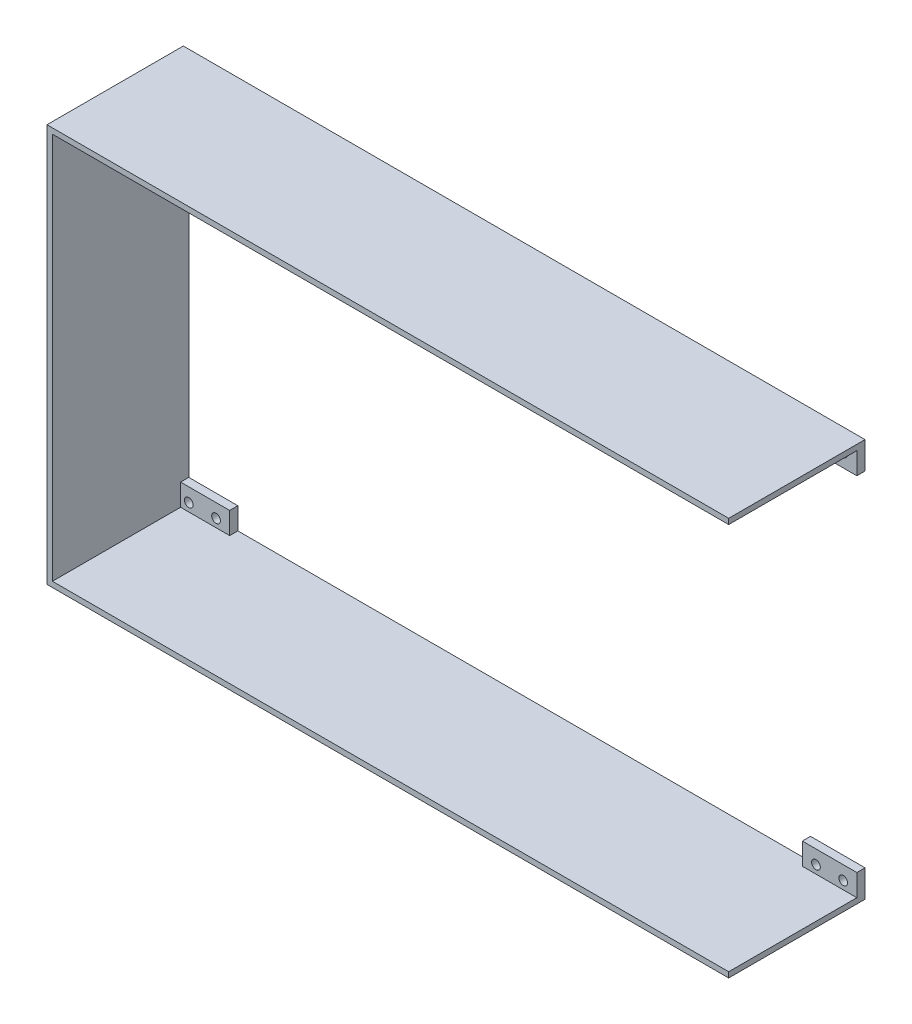
ISO-10303-21;
HEADER;
FILE_DESCRIPTION(('STEP AP214'),'2;1');
FILE_NAME('part.step','',(''),(''),'','','');
FILE_SCHEMA(('AUTOMOTIVE_DESIGN { 1 0 10303 214 1 1 1 1 }'));
ENDSEC;
DATA;
#1=APPLICATION_CONTEXT('core data for automotive mechanical design processes');
#2=APPLICATION_PROTOCOL_DEFINITION('international standard','automotive_design',2000,#1);
#3=PRODUCT_CONTEXT('',#1,'mechanical');
#4=PRODUCT('Part','Part','',(#3));
#5=PRODUCT_RELATED_PRODUCT_CATEGORY('part','',(#4));
#6=PRODUCT_DEFINITION_FORMATION('','',#4);
#7=PRODUCT_DEFINITION_CONTEXT('part definition',#1,'design');
#8=PRODUCT_DEFINITION('design','',#6,#7);
#9=PRODUCT_DEFINITION_SHAPE('','',#8);
#10=(LENGTH_UNIT() NAMED_UNIT(*) SI_UNIT(.MILLI.,.METRE.));
#11=(NAMED_UNIT(*) PLANE_ANGLE_UNIT() SI_UNIT($,.RADIAN.));
#12=(NAMED_UNIT(*) SI_UNIT($,.STERADIAN.) SOLID_ANGLE_UNIT());
#13=UNCERTAINTY_MEASURE_WITH_UNIT(LENGTH_MEASURE(1.E-05),#10,'distance_accuracy_value','');
#14=(GEOMETRIC_REPRESENTATION_CONTEXT(3) GLOBAL_UNCERTAINTY_ASSIGNED_CONTEXT((#13)) GLOBAL_UNIT_ASSIGNED_CONTEXT((#10,
#11,#12)) REPRESENTATION_CONTEXT('',''));
#15=CARTESIAN_POINT('',(0.,0.,0.));
#16=DIRECTION('',(0.,0.,1.));
#17=DIRECTION('',(1.,0.,0.));
#18=AXIS2_PLACEMENT_3D('',#15,#16,#17);
#19=CARTESIAN_POINT('',(96.8202985640199,95.044477559996,50.));
#20=DIRECTION('',(0.,1.,0.));
#21=DIRECTION('',(0.,0.,1.));
#22=AXIS2_PLACEMENT_3D('',#19,#20,#21);
#23=PLANE('',#22);
#24=DIRECTION('',(-1.,0.,0.));
#25=VECTOR('',#24,1.);
#26=CARTESIAN_POINT('',(96.8202985640199,95.044477559996,3.));
#27=LINE('',#26,#25);
#28=CARTESIAN_POINT('',(-131.17970143598,95.044477559996,3.));
#29=VERTEX_POINT('',#28);
#30=CARTESIAN_POINT('',(-149.17970143598,95.044477559996,3.));
#31=VERTEX_POINT('',#30);
#32=EDGE_CURVE('E58',#29,#31,#27,.T.);
#33=ORIENTED_EDGE('',*,*,#32,.F.);
#34=DIRECTION('',(0.,0.,1.));
#35=VECTOR('',#34,1.);
#36=CARTESIAN_POINT('',(-131.17970143598,95.044477559996,50.));
#37=LINE('',#36,#35);
#38=CARTESIAN_POINT('',(-131.17970143598,95.044477559996,0.));
#39=VERTEX_POINT('',#38);
#40=EDGE_CURVE('E226',#39,#29,#37,.T.);
#41=ORIENTED_EDGE('',*,*,#40,.F.);
#42=DIRECTION('',(1.,0.,0.));
#43=VECTOR('',#42,1.);
#44=CARTESIAN_POINT('',(96.8202985640199,95.044477559996,0.));
#45=LINE('',#44,#43);
#46=CARTESIAN_POINT('',(78.8202985640199,95.044477559996,0.));
#47=VERTEX_POINT('',#46);
#48=EDGE_CURVE('E205',#39,#47,#45,.T.);
#49=ORIENTED_EDGE('',*,*,#48,.T.);
#50=DIRECTION('',(0.,0.,-1.));
#51=VECTOR('',#50,1.);
#52=CARTESIAN_POINT('',(78.8202985640199,95.044477559996,50.));
#53=LINE('',#52,#51);
#54=CARTESIAN_POINT('',(78.8202985640199,95.044477559996,3.));
#55=VERTEX_POINT('',#54);
#56=EDGE_CURVE('E277',#55,#47,#53,.T.);
#57=ORIENTED_EDGE('',*,*,#56,.F.);
#58=DIRECTION('',(-1.,0.,0.));
#59=VECTOR('',#58,1.);
#60=CARTESIAN_POINT('',(96.8202985640199,95.044477559996,3.));
#61=LINE('',#60,#59);
#62=CARTESIAN_POINT('',(98.8202985640199,95.044477559996,3.));
#63=VERTEX_POINT('',#62);
#64=EDGE_CURVE('E284',#63,#55,#61,.T.);
#65=ORIENTED_EDGE('',*,*,#64,.F.);
#66=DIRECTION('',(0.,0.,-1.));
#67=VECTOR('',#66,1.);
#68=CARTESIAN_POINT('',(98.8202985640199,95.044477559996,50.));
#69=LINE('',#68,#67);
#70=CARTESIAN_POINT('',(98.8202985640199,95.044477559996,50.));
#71=VERTEX_POINT('',#70);
#72=EDGE_CURVE('E440',#71,#63,#69,.T.);
#73=ORIENTED_EDGE('',*,*,#72,.F.);
#74=DIRECTION('',(1.,0.,0.));
#75=VECTOR('',#74,1.);
#76=CARTESIAN_POINT('',(-149.17970143598,95.044477559996,50.));
#77=LINE('',#76,#75);
#78=CARTESIAN_POINT('',(-149.17970143598,95.044477559996,50.));
#79=VERTEX_POINT('',#78);
#80=EDGE_CURVE('E401',#79,#71,#77,.T.);
#81=ORIENTED_EDGE('',*,*,#80,.F.);
#82=DIRECTION('',(0.,0.,-1.));
#83=VECTOR('',#82,1.);
#84=CARTESIAN_POINT('',(-149.17970143598,95.044477559996,50.));
#85=LINE('',#84,#83);
#86=EDGE_CURVE('E444',#79,#31,#85,.T.);
#87=ORIENTED_EDGE('',*,*,#86,.T.);
#88=EDGE_LOOP('',(#33,#41,#49,#57,#65,#73,#81,#87));
#89=FACE_BOUND('',#88,.T.);
#90=ADVANCED_FACE('F42',(#89),#23,.F.);
#91=CARTESIAN_POINT('',(-149.17970143598,95.044477559996,50.));
#92=DIRECTION('',(-1.,0.,0.));
#93=DIRECTION('',(0.,0.,1.));
#94=AXIS2_PLACEMENT_3D('',#91,#92,#93);
#95=PLANE('',#94);
#96=DIRECTION('',(0.,-1.,0.));
#97=VECTOR('',#96,1.);
#98=CARTESIAN_POINT('',(-149.17970143598,95.044477559996,3.));
#99=LINE('',#98,#97);
#100=CARTESIAN_POINT('',(-149.17970143598,87.044477559996,3.));
#101=VERTEX_POINT('',#100);
#102=EDGE_CURVE('E234',#31,#101,#99,.T.);
#103=ORIENTED_EDGE('',*,*,#102,.F.);
#104=ORIENTED_EDGE('',*,*,#86,.F.);
#105=DIRECTION('',(0.,1.,0.));
#106=VECTOR('',#105,1.);
#107=CARTESIAN_POINT('',(-149.17970143598,95.044477559996,50.));
#108=LINE('',#107,#106);
#109=CARTESIAN_POINT('',(-149.17970143598,-46.955522440004,50.));
#110=VERTEX_POINT('',#109);
#111=EDGE_CURVE('E398',#110,#79,#108,.T.);
#112=ORIENTED_EDGE('',*,*,#111,.F.);
#113=DIRECTION('',(0.,0.,-1.));
#114=VECTOR('',#113,1.);
#115=CARTESIAN_POINT('',(-149.17970143598,-46.955522440004,50.));
#116=LINE('',#115,#114);
#117=CARTESIAN_POINT('',(-149.17970143598,-46.955522440004,3.));
#118=VERTEX_POINT('',#117);
#119=EDGE_CURVE('E447',#110,#118,#116,.T.);
#120=ORIENTED_EDGE('',*,*,#119,.T.);
#121=DIRECTION('',(0.,-1.,0.));
#122=VECTOR('',#121,1.);
#123=CARTESIAN_POINT('',(-149.17970143598,95.044477559996,3.));
#124=LINE('',#123,#122);
#125=CARTESIAN_POINT('',(-149.17970143598,-38.955522440004,3.));
#126=VERTEX_POINT('',#125);
#127=EDGE_CURVE('E11',#126,#118,#124,.T.);
#128=ORIENTED_EDGE('',*,*,#127,.F.);
#129=DIRECTION('',(0.,0.,1.));
#130=VECTOR('',#129,1.);
#131=CARTESIAN_POINT('',(-149.17970143598,-38.955522440004,50.));
#132=LINE('',#131,#130);
#133=CARTESIAN_POINT('',(-149.17970143598,-38.955522440004,0.));
#134=VERTEX_POINT('',#133);
#135=EDGE_CURVE('E371',#134,#126,#132,.T.);
#136=ORIENTED_EDGE('',*,*,#135,.F.);
#137=DIRECTION('',(0.,1.,0.));
#138=VECTOR('',#137,1.);
#139=CARTESIAN_POINT('',(-149.17970143598,95.044477559996,0.));
#140=LINE('',#139,#138);
#141=CARTESIAN_POINT('',(-149.17970143598,87.044477559996,0.));
#142=VERTEX_POINT('',#141);
#143=EDGE_CURVE('E423',#134,#142,#140,.T.);
#144=ORIENTED_EDGE('',*,*,#143,.T.);
#145=DIRECTION('',(0.,0.,-1.));
#146=VECTOR('',#145,1.);
#147=CARTESIAN_POINT('',(-149.17970143598,87.044477559996,50.));
#148=LINE('',#147,#146);
#149=EDGE_CURVE('E66',#101,#142,#148,.T.);
#150=ORIENTED_EDGE('',*,*,#149,.F.);
#151=EDGE_LOOP('',(#103,#104,#112,#120,#128,#136,#144,#150));
#152=FACE_BOUND('',#151,.T.);
#153=ADVANCED_FACE('F514',(#152),#95,.F.);
#154=CARTESIAN_POINT('',(-149.17970143598,-46.955522440004,50.));
#155=DIRECTION('',(0.,-1.,0.));
#156=DIRECTION('',(0.,0.,-1.));
#157=AXIS2_PLACEMENT_3D('',#154,#155,#156);
#158=PLANE('',#157);
#159=DIRECTION('',(1.,0.,0.));
#160=VECTOR('',#159,1.);
#161=CARTESIAN_POINT('',(-149.17970143598,-46.955522440004,3.));
#162=LINE('',#161,#160);
#163=CARTESIAN_POINT('',(78.8202985640199,-46.955522440004,3.));
#164=VERTEX_POINT('',#163);
#165=CARTESIAN_POINT('',(98.8202985640199,-46.955522440004,3.));
#166=VERTEX_POINT('',#165);
#167=EDGE_CURVE('E333',#164,#166,#162,.T.);
#168=ORIENTED_EDGE('',*,*,#167,.F.);
#169=DIRECTION('',(0.,0.,1.));
#170=VECTOR('',#169,1.);
#171=CARTESIAN_POINT('',(78.8202985640199,-46.955522440004,50.));
#172=LINE('',#171,#170);
#173=CARTESIAN_POINT('',(78.8202985640199,-46.955522440004,0.));
#174=VERTEX_POINT('',#173);
#175=EDGE_CURVE('E326',#174,#164,#172,.T.);
#176=ORIENTED_EDGE('',*,*,#175,.F.);
#177=DIRECTION('',(-1.,0.,0.));
#178=VECTOR('',#177,1.);
#179=CARTESIAN_POINT('',(-149.17970143598,-46.955522440004,0.));
#180=LINE('',#179,#178);
#181=CARTESIAN_POINT('',(-131.17970143598,-46.955522440004,0.));
#182=VERTEX_POINT('',#181);
#183=EDGE_CURVE('E420',#174,#182,#180,.T.);
#184=ORIENTED_EDGE('',*,*,#183,.T.);
#185=DIRECTION('',(0.,0.,-1.));
#186=VECTOR('',#185,1.);
#187=CARTESIAN_POINT('',(-131.17970143598,-46.955522440004,50.));
#188=LINE('',#187,#186);
#189=CARTESIAN_POINT('',(-131.17970143598,-46.955522440004,3.));
#190=VERTEX_POINT('',#189);
#191=EDGE_CURVE('E375',#190,#182,#188,.T.);
#192=ORIENTED_EDGE('',*,*,#191,.F.);
#193=DIRECTION('',(1.,0.,0.));
#194=VECTOR('',#193,1.);
#195=CARTESIAN_POINT('',(-149.17970143598,-46.955522440004,3.));
#196=LINE('',#195,#194);
#197=EDGE_CURVE('E379',#118,#190,#196,.T.);
#198=ORIENTED_EDGE('',*,*,#197,.F.);
#199=ORIENTED_EDGE('',*,*,#119,.F.);
#200=DIRECTION('',(-1.,0.,0.));
#201=VECTOR('',#200,1.);
#202=CARTESIAN_POINT('',(96.8202985640199,-46.955522440004,50.));
#203=LINE('',#202,#201);
#204=CARTESIAN_POINT('',(98.8202985640199,-46.955522440004,50.));
#205=VERTEX_POINT('',#204);
#206=EDGE_CURVE('E395',#205,#110,#203,.T.);
#207=ORIENTED_EDGE('',*,*,#206,.F.);
#208=DIRECTION('',(0.,0.,-1.));
#209=VECTOR('',#208,1.);
#210=CARTESIAN_POINT('',(98.8202985640199,-46.955522440004,50.));
#211=LINE('',#210,#209);
#212=EDGE_CURVE('E451',#205,#166,#211,.T.);
#213=ORIENTED_EDGE('',*,*,#212,.T.);
#214=EDGE_LOOP('',(#168,#176,#184,#192,#198,#199,#207,#213));
#215=FACE_BOUND('',#214,.T.);
#216=ADVANCED_FACE('F486',(#215),#158,.F.);
#217=CARTESIAN_POINT('',(-151.17970143598,97.044477559996,50.));
#218=DIRECTION('',(1.,0.,0.));
#219=DIRECTION('',(0.,0.,-1.));
#220=AXIS2_PLACEMENT_3D('',#217,#218,#219);
#221=PLANE('',#220);
#222=DIRECTION('',(0.,0.,-1.));
#223=VECTOR('',#222,1.);
#224=CARTESIAN_POINT('',(-151.17970143598,97.044477559996,50.));
#225=LINE('',#224,#223);
#226=CARTESIAN_POINT('',(-151.17970143598,97.044477559996,50.));
#227=VERTEX_POINT('',#226);
#228=CARTESIAN_POINT('',(-151.17970143598,97.044477559996,0.));
#229=VERTEX_POINT('',#228);
#230=EDGE_CURVE('E410',#227,#229,#225,.T.);
#231=ORIENTED_EDGE('',*,*,#230,.T.);
#232=DIRECTION('',(0.,-1.,0.));
#233=VECTOR('',#232,1.);
#234=CARTESIAN_POINT('',(-151.17970143598,97.044477559996,0.));
#235=LINE('',#234,#233);
#236=CARTESIAN_POINT('',(-151.17970143598,-48.955522440004,0.));
#237=VERTEX_POINT('',#236);
#238=EDGE_CURVE('E383',#229,#237,#235,.T.);
#239=ORIENTED_EDGE('',*,*,#238,.T.);
#240=DIRECTION('',(0.,0.,-1.));
#241=VECTOR('',#240,1.);
#242=CARTESIAN_POINT('',(-151.17970143598,-48.955522440004,50.));
#243=LINE('',#242,#241);
#244=CARTESIAN_POINT('',(-151.17970143598,-48.955522440004,50.));
#245=VERTEX_POINT('',#244);
#246=EDGE_CURVE('E51',#245,#237,#243,.T.);
#247=ORIENTED_EDGE('',*,*,#246,.F.);
#248=DIRECTION('',(0.,-1.,0.));
#249=VECTOR('',#248,1.);
#250=CARTESIAN_POINT('',(-151.17970143598,97.044477559996,50.));
#251=LINE('',#250,#249);
#252=EDGE_CURVE('E384',#227,#245,#251,.T.);
#253=ORIENTED_EDGE('',*,*,#252,.F.);
#254=EDGE_LOOP('',(#231,#239,#247,#253));
#255=FACE_BOUND('',#254,.T.);
#256=ADVANCED_FACE('F44',(#255),#221,.F.);
#257=CARTESIAN_POINT('',(-151.17970143598,-48.955522440004,50.));
#258=DIRECTION('',(0.,1.,0.));
#259=DIRECTION('',(0.,0.,1.));
#260=AXIS2_PLACEMENT_3D('',#257,#258,#259);
#261=PLANE('',#260);
#262=DIRECTION('',(1.,0.,0.));
#263=VECTOR('',#262,1.);
#264=CARTESIAN_POINT('',(-151.17970143598,-48.955522440004,0.));
#265=LINE('',#264,#263);
#266=CARTESIAN_POINT('',(98.8202985640199,-48.955522440004,0.));
#267=VERTEX_POINT('',#266);
#268=EDGE_CURVE('E413',#237,#267,#265,.T.);
#269=ORIENTED_EDGE('',*,*,#268,.T.);
#270=DIRECTION('',(0.,0.,-1.));
#271=VECTOR('',#270,1.);
#272=CARTESIAN_POINT('',(98.8202985640199,-48.955522440004,50.));
#273=LINE('',#272,#271);
#274=CARTESIAN_POINT('',(98.8202985640199,-48.955522440004,50.));
#275=VERTEX_POINT('',#274);
#276=EDGE_CURVE('E454',#275,#267,#273,.T.);
#277=ORIENTED_EDGE('',*,*,#276,.F.);
#278=DIRECTION('',(1.,0.,0.));
#279=VECTOR('',#278,1.);
#280=CARTESIAN_POINT('',(-151.17970143598,-48.955522440004,50.));
#281=LINE('',#280,#279);
#282=EDGE_CURVE('E388',#245,#275,#281,.T.);
#283=ORIENTED_EDGE('',*,*,#282,.F.);
#284=ORIENTED_EDGE('',*,*,#246,.T.);
#285=EDGE_LOOP('',(#269,#277,#283,#284));
#286=FACE_BOUND('',#285,.T.);
#287=ADVANCED_FACE('F461',(#286),#261,.F.);
#288=CARTESIAN_POINT('',(98.8202985640199,-46.955522440004,50.));
#289=DIRECTION('',(-1.,0.,0.));
#290=DIRECTION('',(0.,0.,1.));
#291=AXIS2_PLACEMENT_3D('',#288,#289,#290);
#292=PLANE('',#291);
#293=DIRECTION('',(0.,1.,0.));
#294=VECTOR('',#293,1.);
#295=CARTESIAN_POINT('',(98.8202985640199,-46.955522440004,0.));
#296=LINE('',#295,#294);
#297=CARTESIAN_POINT('',(98.8202985640199,-38.955522440004,0.));
#298=VERTEX_POINT('',#297);
#299=EDGE_CURVE('E417',#267,#298,#296,.T.);
#300=ORIENTED_EDGE('',*,*,#299,.T.);
#301=DIRECTION('',(0.,0.,-1.));
#302=VECTOR('',#301,1.);
#303=CARTESIAN_POINT('',(98.8202985640199,-38.955522440004,3.));
#304=LINE('',#303,#302);
#305=CARTESIAN_POINT('',(98.8202985640199,-38.955522440004,3.));
#306=VERTEX_POINT('',#305);
#307=EDGE_CURVE('E288',#306,#298,#304,.T.);
#308=ORIENTED_EDGE('',*,*,#307,.F.);
#309=DIRECTION('',(0.,1.,0.));
#310=VECTOR('',#309,1.);
#311=CARTESIAN_POINT('',(98.8202985640199,-48.955522440004,3.));
#312=LINE('',#311,#310);
#313=EDGE_CURVE('E302',#166,#306,#312,.T.);
#314=ORIENTED_EDGE('',*,*,#313,.F.);
#315=ORIENTED_EDGE('',*,*,#212,.F.);
#316=DIRECTION('',(0.,1.,0.));
#317=VECTOR('',#316,1.);
#318=CARTESIAN_POINT('',(98.8202985640199,-46.955522440004,50.));
#319=LINE('',#318,#317);
#320=EDGE_CURVE('E392',#275,#205,#319,.T.);
#321=ORIENTED_EDGE('',*,*,#320,.F.);
#322=ORIENTED_EDGE('',*,*,#276,.T.);
#323=EDGE_LOOP('',(#300,#308,#314,#315,#321,#322));
#324=FACE_BOUND('',#323,.T.);
#325=ADVANCED_FACE('F472',(#324),#292,.F.);
#326=CARTESIAN_POINT('',(98.8202985640199,97.044477559996,50.));
#327=DIRECTION('',(-1.,0.,0.));
#328=DIRECTION('',(0.,0.,1.));
#329=AXIS2_PLACEMENT_3D('',#326,#327,#328);
#330=PLANE('',#329);
#331=DIRECTION('',(0.,1.,0.));
#332=VECTOR('',#331,1.);
#333=CARTESIAN_POINT('',(98.8202985640199,97.044477559996,0.));
#334=LINE('',#333,#332);
#335=CARTESIAN_POINT('',(98.8202985640199,87.044477559996,0.));
#336=VERTEX_POINT('',#335);
#337=CARTESIAN_POINT('',(98.8202985640199,97.044477559996,0.));
#338=VERTEX_POINT('',#337);
#339=EDGE_CURVE('E428',#336,#338,#334,.T.);
#340=ORIENTED_EDGE('',*,*,#339,.T.);
#341=DIRECTION('',(0.,0.,-1.));
#342=VECTOR('',#341,1.);
#343=CARTESIAN_POINT('',(98.8202985640199,97.044477559996,50.));
#344=LINE('',#343,#342);
#345=CARTESIAN_POINT('',(98.8202985640199,97.044477559996,50.));
#346=VERTEX_POINT('',#345);
#347=EDGE_CURVE('E437',#346,#338,#344,.T.);
#348=ORIENTED_EDGE('',*,*,#347,.F.);
#349=DIRECTION('',(0.,1.,0.));
#350=VECTOR('',#349,1.);
#351=CARTESIAN_POINT('',(98.8202985640199,97.044477559996,50.));
#352=LINE('',#351,#350);
#353=EDGE_CURVE('E404',#71,#346,#352,.T.);
#354=ORIENTED_EDGE('',*,*,#353,.F.);
#355=ORIENTED_EDGE('',*,*,#72,.T.);
#356=DIRECTION('',(0.,1.,0.));
#357=VECTOR('',#356,1.);
#358=CARTESIAN_POINT('',(98.8202985640199,97.044477559996,3.));
#359=LINE('',#358,#357);
#360=CARTESIAN_POINT('',(98.8202985640199,87.044477559996,3.));
#361=VERTEX_POINT('',#360);
#362=EDGE_CURVE('E253',#361,#63,#359,.T.);
#363=ORIENTED_EDGE('',*,*,#362,.F.);
#364=DIRECTION('',(0.,0.,-1.));
#365=VECTOR('',#364,1.);
#366=CARTESIAN_POINT('',(98.8202985640199,87.044477559996,3.));
#367=LINE('',#366,#365);
#368=EDGE_CURVE('E243',#361,#336,#367,.T.);
#369=ORIENTED_EDGE('',*,*,#368,.T.);
#370=EDGE_LOOP('',(#340,#348,#354,#355,#363,#369));
#371=FACE_BOUND('',#370,.T.);
#372=ADVANCED_FACE('F504',(#371),#330,.F.);
#373=CARTESIAN_POINT('',(-151.17970143598,97.044477559996,50.));
#374=DIRECTION('',(0.,-1.,0.));
#375=DIRECTION('',(0.,0.,-1.));
#376=AXIS2_PLACEMENT_3D('',#373,#374,#375);
#377=PLANE('',#376);
#378=DIRECTION('',(-1.,0.,0.));
#379=VECTOR('',#378,1.);
#380=CARTESIAN_POINT('',(-151.17970143598,97.044477559996,0.));
#381=LINE('',#380,#379);
#382=EDGE_CURVE('E389',#338,#229,#381,.T.);
#383=ORIENTED_EDGE('',*,*,#382,.T.);
#384=ORIENTED_EDGE('',*,*,#230,.F.);
#385=DIRECTION('',(-1.,0.,0.));
#386=VECTOR('',#385,1.);
#387=CARTESIAN_POINT('',(-151.17970143598,97.044477559996,50.));
#388=LINE('',#387,#386);
#389=EDGE_CURVE('E407',#346,#227,#388,.T.);
#390=ORIENTED_EDGE('',*,*,#389,.F.);
#391=ORIENTED_EDGE('',*,*,#347,.T.);
#392=EDGE_LOOP('',(#383,#384,#390,#391));
#393=FACE_BOUND('',#392,.T.);
#394=ADVANCED_FACE('F494',(#393),#377,.F.);
#395=CARTESIAN_POINT('',(0.,0.,50.));
#396=DIRECTION('',(0.,0.,1.));
#397=DIRECTION('',(1.,0.,0.));
#398=AXIS2_PLACEMENT_3D('',#395,#396,#397);
#399=PLANE('',#398);
#400=ORIENTED_EDGE('',*,*,#252,.T.);
#401=ORIENTED_EDGE('',*,*,#282,.T.);
#402=ORIENTED_EDGE('',*,*,#320,.T.);
#403=ORIENTED_EDGE('',*,*,#206,.T.);
#404=ORIENTED_EDGE('',*,*,#111,.T.);
#405=ORIENTED_EDGE('',*,*,#80,.T.);
#406=ORIENTED_EDGE('',*,*,#353,.T.);
#407=ORIENTED_EDGE('',*,*,#389,.T.);
#408=EDGE_LOOP('',(#400,#401,#402,#403,#404,#405,#406,#407));
#409=FACE_BOUND('',#408,.T.);
#410=ADVANCED_FACE('F489',(#409),#399,.T.);
#411=CARTESIAN_POINT('',(0.,0.,0.));
#412=DIRECTION('',(0.,0.,1.));
#413=DIRECTION('',(1.,0.,0.));
#414=AXIS2_PLACEMENT_3D('',#411,#412,#413);
#415=PLANE('',#414);
#416=ORIENTED_EDGE('',*,*,#48,.F.);
#417=DIRECTION('',(0.,1.,0.));
#418=VECTOR('',#417,1.);
#419=CARTESIAN_POINT('',(-131.17970143598,97.044477559996,0.));
#420=LINE('',#419,#418);
#421=CARTESIAN_POINT('',(-131.17970143598,87.044477559996,0.));
#422=VERTEX_POINT('',#421);
#423=EDGE_CURVE('E192',#422,#39,#420,.T.);
#424=ORIENTED_EDGE('',*,*,#423,.F.);
#425=DIRECTION('',(1.,0.,0.));
#426=VECTOR('',#425,1.);
#427=CARTESIAN_POINT('',(-151.17970143598,87.044477559996,0.));
#428=LINE('',#427,#426);
#429=EDGE_CURVE('E181',#142,#422,#428,.T.);
#430=ORIENTED_EDGE('',*,*,#429,.F.);
#431=ORIENTED_EDGE('',*,*,#143,.F.);
#432=DIRECTION('',(-1.,0.,0.));
#433=VECTOR('',#432,1.);
#434=CARTESIAN_POINT('',(-151.17970143598,-38.955522440004,0.));
#435=LINE('',#434,#433);
#436=CARTESIAN_POINT('',(-131.17970143598,-38.955522440004,0.));
#437=VERTEX_POINT('',#436);
#438=EDGE_CURVE('E358',#437,#134,#435,.T.);
#439=ORIENTED_EDGE('',*,*,#438,.F.);
#440=DIRECTION('',(0.,1.,0.));
#441=VECTOR('',#440,1.);
#442=CARTESIAN_POINT('',(-131.17970143598,-48.955522440004,0.));
#443=LINE('',#442,#441);
#444=EDGE_CURVE('E350',#182,#437,#443,.T.);
#445=ORIENTED_EDGE('',*,*,#444,.F.);
#446=ORIENTED_EDGE('',*,*,#183,.F.);
#447=DIRECTION('',(0.,-1.,0.));
#448=VECTOR('',#447,1.);
#449=CARTESIAN_POINT('',(78.8202985640199,-48.955522440004,0.));
#450=LINE('',#449,#448);
#451=CARTESIAN_POINT('',(78.8202985640199,-38.955522440004,0.));
#452=VERTEX_POINT('',#451);
#453=EDGE_CURVE('E297',#452,#174,#450,.T.);
#454=ORIENTED_EDGE('',*,*,#453,.F.);
#455=DIRECTION('',(-1.,0.,0.));
#456=VECTOR('',#455,1.);
#457=CARTESIAN_POINT('',(98.8202985640199,-38.955522440004,0.));
#458=LINE('',#457,#456);
#459=EDGE_CURVE('E301',#298,#452,#458,.T.);
#460=ORIENTED_EDGE('',*,*,#459,.F.);
#461=ORIENTED_EDGE('',*,*,#299,.F.);
#462=ORIENTED_EDGE('',*,*,#268,.F.);
#463=ORIENTED_EDGE('',*,*,#238,.F.);
#464=ORIENTED_EDGE('',*,*,#382,.F.);
#465=ORIENTED_EDGE('',*,*,#339,.F.);
#466=DIRECTION('',(1.,0.,0.));
#467=VECTOR('',#466,1.);
#468=CARTESIAN_POINT('',(98.8202985640199,87.044477559996,0.));
#469=LINE('',#468,#467);
#470=CARTESIAN_POINT('',(78.8202985640199,87.044477559996,0.));
#471=VERTEX_POINT('',#470);
#472=EDGE_CURVE('E248',#471,#336,#469,.T.);
#473=ORIENTED_EDGE('',*,*,#472,.F.);
#474=DIRECTION('',(0.,-1.,0.));
#475=VECTOR('',#474,1.);
#476=CARTESIAN_POINT('',(78.8202985640199,97.044477559996,0.));
#477=LINE('',#476,#475);
#478=EDGE_CURVE('E252',#47,#471,#477,.T.);
#479=ORIENTED_EDGE('',*,*,#478,.F.);
#480=EDGE_LOOP('',(#416,#424,#430,#431,#439,#445,#446,#454,#460,#461,#462,#463,#464,#465,#473,#479));
#481=FACE_BOUND('',#480,.T.);
#482=CARTESIAN_POINT('',(93.8202985640198,92.044477559996,0.));
#483=DIRECTION('',(0.,0.,1.));
#484=DIRECTION('',(1.,0.,0.));
#485=AXIS2_PLACEMENT_3D('',#482,#483,#484);
#486=CIRCLE('',#485,1.59999999999996);
#487=CARTESIAN_POINT('',(95.4202985640198,92.044477559996,0.));
#488=VERTEX_POINT('',#487);
#489=EDGE_CURVE('E265',#488,#488,#486,.T.);
#490=ORIENTED_EDGE('',*,*,#489,.T.);
#491=EDGE_LOOP('',(#490));
#492=FACE_BOUND('',#491,.T.);
#493=CARTESIAN_POINT('',(83.8202985640198,92.044477559996,0.));
#494=DIRECTION('',(0.,0.,1.));
#495=DIRECTION('',(1.,0.,0.));
#496=AXIS2_PLACEMENT_3D('',#493,#494,#495);
#497=CIRCLE('',#496,1.59999999999996);
#498=CARTESIAN_POINT('',(85.4202985640198,92.044477559996,0.));
#499=VERTEX_POINT('',#498);
#500=EDGE_CURVE('E273',#499,#499,#497,.T.);
#501=ORIENTED_EDGE('',*,*,#500,.T.);
#502=EDGE_LOOP('',(#501));
#503=FACE_BOUND('',#502,.T.);
#504=CARTESIAN_POINT('',(-146.17970143598,-43.955522440004,0.));
#505=DIRECTION('',(0.,0.,1.));
#506=DIRECTION('',(1.,0.,0.));
#507=AXIS2_PLACEMENT_3D('',#504,#505,#506);
#508=CIRCLE('',#507,1.59999999999996);
#509=CARTESIAN_POINT('',(-144.57970143598,-43.955522440004,0.));
#510=VERTEX_POINT('',#509);
#511=EDGE_CURVE('E342',#510,#510,#508,.T.);
#512=ORIENTED_EDGE('',*,*,#511,.T.);
#513=EDGE_LOOP('',(#512));
#514=FACE_BOUND('',#513,.T.);
#515=CARTESIAN_POINT('',(-136.17970143598,-43.955522440004,0.));
#516=DIRECTION('',(0.,0.,1.));
#517=DIRECTION('',(1.,0.,0.));
#518=AXIS2_PLACEMENT_3D('',#515,#516,#517);
#519=CIRCLE('',#518,1.59999999999996);
#520=CARTESIAN_POINT('',(-134.57970143598,-43.955522440004,0.));
#521=VERTEX_POINT('',#520);
#522=EDGE_CURVE('E337',#521,#521,#519,.T.);
#523=ORIENTED_EDGE('',*,*,#522,.T.);
#524=EDGE_LOOP('',(#523));
#525=FACE_BOUND('',#524,.T.);
#526=CARTESIAN_POINT('',(93.8202985640198,-43.955522440004,0.));
#527=DIRECTION('',(0.,0.,1.));
#528=DIRECTION('',(-1.,0.,0.));
#529=AXIS2_PLACEMENT_3D('',#526,#527,#528);
#530=CIRCLE('',#529,1.59999999999996);
#531=CARTESIAN_POINT('',(92.2202985640198,-43.955522440004,0.));
#532=VERTEX_POINT('',#531);
#533=EDGE_CURVE('E322',#532,#532,#530,.T.);
#534=ORIENTED_EDGE('',*,*,#533,.T.);
#535=EDGE_LOOP('',(#534));
#536=FACE_BOUND('',#535,.T.);
#537=CARTESIAN_POINT('',(83.8202985640198,-43.955522440004,0.));
#538=DIRECTION('',(0.,0.,1.));
#539=DIRECTION('',(-1.,0.,0.));
#540=AXIS2_PLACEMENT_3D('',#537,#538,#539);
#541=CIRCLE('',#540,1.59999999999996);
#542=CARTESIAN_POINT('',(82.2202985640198,-43.955522440004,0.));
#543=VERTEX_POINT('',#542);
#544=EDGE_CURVE('E314',#543,#543,#541,.T.);
#545=ORIENTED_EDGE('',*,*,#544,.T.);
#546=EDGE_LOOP('',(#545));
#547=FACE_BOUND('',#546,.T.);
#548=CARTESIAN_POINT('',(-146.17970143598,92.044477559996,0.));
#549=DIRECTION('',(0.,0.,1.));
#550=DIRECTION('',(-1.,0.,0.));
#551=AXIS2_PLACEMENT_3D('',#548,#549,#550);
#552=CIRCLE('',#551,1.59999999999996);
#553=CARTESIAN_POINT('',(-147.77970143598,92.044477559996,0.));
#554=VERTEX_POINT('',#553);
#555=EDGE_CURVE('E222',#554,#554,#552,.T.);
#556=ORIENTED_EDGE('',*,*,#555,.T.);
#557=EDGE_LOOP('',(#556));
#558=FACE_BOUND('',#557,.T.);
#559=CARTESIAN_POINT('',(-136.17970143598,92.044477559996,0.));
#560=DIRECTION('',(0.,0.,1.));
#561=DIRECTION('',(-1.,0.,0.));
#562=AXIS2_PLACEMENT_3D('',#559,#560,#561);
#563=CIRCLE('',#562,1.59999999999996);
#564=CARTESIAN_POINT('',(-137.77970143598,92.044477559996,0.));
#565=VERTEX_POINT('',#564);
#566=EDGE_CURVE('E214',#565,#565,#563,.T.);
#567=ORIENTED_EDGE('',*,*,#566,.T.);
#568=EDGE_LOOP('',(#567));
#569=FACE_BOUND('',#568,.T.);
#570=ADVANCED_FACE('F202',(#481,#492,#503,#514,#525,#536,#547,#558,#569),#415,.F.);
#571=CARTESIAN_POINT('',(0.,0.,3.));
#572=DIRECTION('',(0.,0.,-1.));
#573=DIRECTION('',(-1.,0.,0.));
#574=AXIS2_PLACEMENT_3D('',#571,#572,#573);
#575=PLANE('',#574);
#576=CARTESIAN_POINT('',(-146.17970143598,-43.955522440004,3.));
#577=DIRECTION('',(0.,0.,1.));
#578=DIRECTION('',(1.,0.,0.));
#579=AXIS2_PLACEMENT_3D('',#576,#577,#578);
#580=CIRCLE('',#579,1.59999999999996);
#581=CARTESIAN_POINT('',(-144.57970143598,-43.955522440004,3.));
#582=VERTEX_POINT('',#581);
#583=EDGE_CURVE('E346',#582,#582,#580,.T.);
#584=ORIENTED_EDGE('',*,*,#583,.F.);
#585=EDGE_LOOP('',(#584));
#586=FACE_BOUND('',#585,.T.);
#587=CARTESIAN_POINT('',(-136.17970143598,-43.955522440004,3.));
#588=DIRECTION('',(0.,0.,1.));
#589=DIRECTION('',(1.,0.,0.));
#590=AXIS2_PLACEMENT_3D('',#587,#588,#589);
#591=CIRCLE('',#590,1.59999999999996);
#592=CARTESIAN_POINT('',(-134.57970143598,-43.955522440004,3.));
#593=VERTEX_POINT('',#592);
#594=EDGE_CURVE('E338',#593,#593,#591,.T.);
#595=ORIENTED_EDGE('',*,*,#594,.F.);
#596=EDGE_LOOP('',(#595));
#597=FACE_BOUND('',#596,.T.);
#598=ORIENTED_EDGE('',*,*,#127,.T.);
#599=ORIENTED_EDGE('',*,*,#197,.T.);
#600=DIRECTION('',(0.,1.,0.));
#601=VECTOR('',#600,1.);
#602=CARTESIAN_POINT('',(-131.17970143598,-48.955522440004,3.));
#603=LINE('',#602,#601);
#604=CARTESIAN_POINT('',(-131.17970143598,-38.955522440004,3.));
#605=VERTEX_POINT('',#604);
#606=EDGE_CURVE('E354',#190,#605,#603,.T.);
#607=ORIENTED_EDGE('',*,*,#606,.T.);
#608=DIRECTION('',(-1.,0.,0.));
#609=VECTOR('',#608,1.);
#610=CARTESIAN_POINT('',(-151.17970143598,-38.955522440004,3.));
#611=LINE('',#610,#609);
#612=EDGE_CURVE('E357',#605,#126,#611,.T.);
#613=ORIENTED_EDGE('',*,*,#612,.T.);
#614=EDGE_LOOP('',(#598,#599,#607,#613));
#615=FACE_BOUND('',#614,.T.);
#616=ADVANCED_FACE('F517',(#586,#597,#615),#575,.F.);
#617=CARTESIAN_POINT('',(-131.17970143598,-48.955522440004,3.));
#618=DIRECTION('',(-1.,0.,0.));
#619=DIRECTION('',(0.,0.,1.));
#620=AXIS2_PLACEMENT_3D('',#617,#618,#619);
#621=PLANE('',#620);
#622=ORIENTED_EDGE('',*,*,#606,.F.);
#623=ORIENTED_EDGE('',*,*,#191,.T.);
#624=ORIENTED_EDGE('',*,*,#444,.T.);
#625=DIRECTION('',(0.,0.,-1.));
#626=VECTOR('',#625,1.);
#627=CARTESIAN_POINT('',(-131.17970143598,-38.955522440004,3.));
#628=LINE('',#627,#626);
#629=EDGE_CURVE('E362',#605,#437,#628,.T.);
#630=ORIENTED_EDGE('',*,*,#629,.F.);
#631=EDGE_LOOP('',(#622,#623,#624,#630));
#632=FACE_BOUND('',#631,.T.);
#633=ADVANCED_FACE('F527',(#632),#621,.F.);
#634=CARTESIAN_POINT('',(-151.17970143598,-38.955522440004,3.));
#635=DIRECTION('',(0.,-1.,0.));
#636=DIRECTION('',(0.,0.,-1.));
#637=AXIS2_PLACEMENT_3D('',#634,#635,#636);
#638=PLANE('',#637);
#639=ORIENTED_EDGE('',*,*,#438,.T.);
#640=ORIENTED_EDGE('',*,*,#135,.T.);
#641=ORIENTED_EDGE('',*,*,#612,.F.);
#642=ORIENTED_EDGE('',*,*,#629,.T.);
#643=EDGE_LOOP('',(#639,#640,#641,#642));
#644=FACE_BOUND('',#643,.T.);
#645=ADVANCED_FACE('F522',(#644),#638,.F.);
#646=CARTESIAN_POINT('',(-146.17970143598,-43.955522440004,3.));
#647=DIRECTION('',(0.,0.,-1.));
#648=DIRECTION('',(-1.,0.,0.));
#649=AXIS2_PLACEMENT_3D('',#646,#647,#648);
#650=CYLINDRICAL_SURFACE('',#649,1.59999999999996);
#651=ORIENTED_EDGE('',*,*,#583,.T.);
#652=EDGE_LOOP('',(#651));
#653=FACE_BOUND('',#652,.T.);
#654=ORIENTED_EDGE('',*,*,#511,.F.);
#655=EDGE_LOOP('',(#654));
#656=FACE_BOUND('',#655,.T.);
#657=ADVANCED_FACE('F616',(#653,#656),#650,.F.);
#658=CARTESIAN_POINT('',(-136.17970143598,-43.955522440004,3.));
#659=DIRECTION('',(0.,0.,-1.));
#660=DIRECTION('',(-1.,0.,0.));
#661=AXIS2_PLACEMENT_3D('',#658,#659,#660);
#662=CYLINDRICAL_SURFACE('',#661,1.59999999999996);
#663=ORIENTED_EDGE('',*,*,#594,.T.);
#664=EDGE_LOOP('',(#663));
#665=FACE_BOUND('',#664,.T.);
#666=ORIENTED_EDGE('',*,*,#522,.F.);
#667=EDGE_LOOP('',(#666));
#668=FACE_BOUND('',#667,.T.);
#669=ADVANCED_FACE('F538',(#665,#668),#662,.F.);
#670=CARTESIAN_POINT('',(0.,0.,3.));
#671=DIRECTION('',(0.,0.,-1.));
#672=DIRECTION('',(-1.,0.,0.));
#673=AXIS2_PLACEMENT_3D('',#670,#671,#672);
#674=PLANE('',#673);
#675=CARTESIAN_POINT('',(83.8202985640198,-43.955522440004,3.));
#676=DIRECTION('',(0.,0.,1.));
#677=DIRECTION('',(-1.,0.,0.));
#678=AXIS2_PLACEMENT_3D('',#675,#676,#677);
#679=CIRCLE('',#678,1.59999999999996);
#680=CARTESIAN_POINT('',(82.2202985640198,-43.955522440004,3.));
#681=VERTEX_POINT('',#680);
#682=EDGE_CURVE('E305',#681,#681,#679,.T.);
#683=ORIENTED_EDGE('',*,*,#682,.F.);
#684=EDGE_LOOP('',(#683));
#685=FACE_BOUND('',#684,.T.);
#686=CARTESIAN_POINT('',(93.8202985640198,-43.955522440004,3.));
#687=DIRECTION('',(0.,0.,1.));
#688=DIRECTION('',(-1.,0.,0.));
#689=AXIS2_PLACEMENT_3D('',#686,#687,#688);
#690=CIRCLE('',#689,1.59999999999996);
#691=CARTESIAN_POINT('',(92.2202985640198,-43.955522440004,3.));
#692=VERTEX_POINT('',#691);
#693=EDGE_CURVE('E318',#692,#692,#690,.T.);
#694=ORIENTED_EDGE('',*,*,#693,.F.);
#695=EDGE_LOOP('',(#694));
#696=FACE_BOUND('',#695,.T.);
#697=DIRECTION('',(0.,-1.,0.));
#698=VECTOR('',#697,1.);
#699=CARTESIAN_POINT('',(78.8202985640199,-48.955522440004,3.));
#700=LINE('',#699,#698);
#701=CARTESIAN_POINT('',(78.8202985640199,-38.955522440004,3.));
#702=VERTEX_POINT('',#701);
#703=EDGE_CURVE('E296',#702,#164,#700,.T.);
#704=ORIENTED_EDGE('',*,*,#703,.T.);
#705=ORIENTED_EDGE('',*,*,#167,.T.);
#706=ORIENTED_EDGE('',*,*,#313,.T.);
#707=DIRECTION('',(-1.,0.,0.));
#708=VECTOR('',#707,1.);
#709=CARTESIAN_POINT('',(98.8202985640199,-38.955522440004,3.));
#710=LINE('',#709,#708);
#711=EDGE_CURVE('E309',#306,#702,#710,.T.);
#712=ORIENTED_EDGE('',*,*,#711,.T.);
#713=EDGE_LOOP('',(#704,#705,#706,#712));
#714=FACE_BOUND('',#713,.T.);
#715=ADVANCED_FACE('F481',(#685,#696,#714),#674,.F.);
#716=CARTESIAN_POINT('',(78.8202985640199,-48.955522440004,3.));
#717=DIRECTION('',(1.,0.,0.));
#718=DIRECTION('',(0.,0.,-1.));
#719=AXIS2_PLACEMENT_3D('',#716,#717,#718);
#720=PLANE('',#719);
#721=ORIENTED_EDGE('',*,*,#453,.T.);
#722=ORIENTED_EDGE('',*,*,#175,.T.);
#723=ORIENTED_EDGE('',*,*,#703,.F.);
#724=DIRECTION('',(0.,0.,-1.));
#725=VECTOR('',#724,1.);
#726=CARTESIAN_POINT('',(78.8202985640199,-38.955522440004,3.));
#727=LINE('',#726,#725);
#728=EDGE_CURVE('E292',#702,#452,#727,.T.);
#729=ORIENTED_EDGE('',*,*,#728,.T.);
#730=EDGE_LOOP('',(#721,#722,#723,#729));
#731=FACE_BOUND('',#730,.T.);
#732=ADVANCED_FACE('F529',(#731),#720,.F.);
#733=CARTESIAN_POINT('',(98.8202985640199,-38.955522440004,3.));
#734=DIRECTION('',(0.,-1.,0.));
#735=DIRECTION('',(0.,0.,-1.));
#736=AXIS2_PLACEMENT_3D('',#733,#734,#735);
#737=PLANE('',#736);
#738=ORIENTED_EDGE('',*,*,#459,.T.);
#739=ORIENTED_EDGE('',*,*,#728,.F.);
#740=ORIENTED_EDGE('',*,*,#711,.F.);
#741=ORIENTED_EDGE('',*,*,#307,.T.);
#742=EDGE_LOOP('',(#738,#739,#740,#741));
#743=FACE_BOUND('',#742,.T.);
#744=ADVANCED_FACE('F477',(#743),#737,.F.);
#745=CARTESIAN_POINT('',(83.8202985640198,-43.955522440004,3.));
#746=DIRECTION('',(0.,0.,-1.));
#747=DIRECTION('',(-1.,0.,0.));
#748=AXIS2_PLACEMENT_3D('',#745,#746,#747);
#749=CYLINDRICAL_SURFACE('',#748,1.59999999999996);
#750=ORIENTED_EDGE('',*,*,#682,.T.);
#751=EDGE_LOOP('',(#750));
#752=FACE_BOUND('',#751,.T.);
#753=ORIENTED_EDGE('',*,*,#544,.F.);
#754=EDGE_LOOP('',(#753));
#755=FACE_BOUND('',#754,.T.);
#756=ADVANCED_FACE('F536',(#752,#755),#749,.F.);
#757=CARTESIAN_POINT('',(93.8202985640198,-43.955522440004,3.));
#758=DIRECTION('',(0.,0.,-1.));
#759=DIRECTION('',(-1.,0.,0.));
#760=AXIS2_PLACEMENT_3D('',#757,#758,#759);
#761=CYLINDRICAL_SURFACE('',#760,1.59999999999996);
#762=ORIENTED_EDGE('',*,*,#693,.T.);
#763=EDGE_LOOP('',(#762));
#764=FACE_BOUND('',#763,.T.);
#765=ORIENTED_EDGE('',*,*,#533,.F.);
#766=EDGE_LOOP('',(#765));
#767=FACE_BOUND('',#766,.T.);
#768=ADVANCED_FACE('F657',(#764,#767),#761,.F.);
#769=CARTESIAN_POINT('',(0.,0.,3.));
#770=DIRECTION('',(0.,0.,-1.));
#771=DIRECTION('',(-1.,0.,0.));
#772=AXIS2_PLACEMENT_3D('',#769,#770,#771);
#773=PLANE('',#772);
#774=CARTESIAN_POINT('',(93.8202985640198,92.044477559996,3.));
#775=DIRECTION('',(0.,0.,1.));
#776=DIRECTION('',(1.,0.,0.));
#777=AXIS2_PLACEMENT_3D('',#774,#775,#776);
#778=CIRCLE('',#777,1.59999999999996);
#779=CARTESIAN_POINT('',(95.4202985640198,92.044477559996,3.));
#780=VERTEX_POINT('',#779);
#781=EDGE_CURVE('E256',#780,#780,#778,.T.);
#782=ORIENTED_EDGE('',*,*,#781,.F.);
#783=EDGE_LOOP('',(#782));
#784=FACE_BOUND('',#783,.T.);
#785=CARTESIAN_POINT('',(83.8202985640198,92.044477559996,3.));
#786=DIRECTION('',(0.,0.,1.));
#787=DIRECTION('',(1.,0.,0.));
#788=AXIS2_PLACEMENT_3D('',#785,#786,#787);
#789=CIRCLE('',#788,1.59999999999996);
#790=CARTESIAN_POINT('',(85.4202985640198,92.044477559996,3.));
#791=VERTEX_POINT('',#790);
#792=EDGE_CURVE('E269',#791,#791,#789,.T.);
#793=ORIENTED_EDGE('',*,*,#792,.F.);
#794=EDGE_LOOP('',(#793));
#795=FACE_BOUND('',#794,.T.);
#796=ORIENTED_EDGE('',*,*,#362,.T.);
#797=ORIENTED_EDGE('',*,*,#64,.T.);
#798=DIRECTION('',(0.,-1.,0.));
#799=VECTOR('',#798,1.);
#800=CARTESIAN_POINT('',(78.8202985640199,97.044477559996,3.));
#801=LINE('',#800,#799);
#802=CARTESIAN_POINT('',(78.8202985640199,87.044477559996,3.));
#803=VERTEX_POINT('',#802);
#804=EDGE_CURVE('E259',#55,#803,#801,.T.);
#805=ORIENTED_EDGE('',*,*,#804,.T.);
#806=DIRECTION('',(1.,0.,0.));
#807=VECTOR('',#806,1.);
#808=CARTESIAN_POINT('',(98.8202985640199,87.044477559996,3.));
#809=LINE('',#808,#807);
#810=EDGE_CURVE('E247',#803,#361,#809,.T.);
#811=ORIENTED_EDGE('',*,*,#810,.T.);
#812=EDGE_LOOP('',(#796,#797,#805,#811));
#813=FACE_BOUND('',#812,.T.);
#814=ADVANCED_FACE('F508',(#784,#795,#813),#773,.F.);
#815=CARTESIAN_POINT('',(78.8202985640199,97.044477559996,3.));
#816=DIRECTION('',(1.,0.,0.));
#817=DIRECTION('',(0.,0.,-1.));
#818=AXIS2_PLACEMENT_3D('',#815,#816,#817);
#819=PLANE('',#818);
#820=ORIENTED_EDGE('',*,*,#804,.F.);
#821=ORIENTED_EDGE('',*,*,#56,.T.);
#822=ORIENTED_EDGE('',*,*,#478,.T.);
#823=DIRECTION('',(0.,0.,-1.));
#824=VECTOR('',#823,1.);
#825=CARTESIAN_POINT('',(78.8202985640199,87.044477559996,3.));
#826=LINE('',#825,#824);
#827=EDGE_CURVE('E239',#803,#471,#826,.T.);
#828=ORIENTED_EDGE('',*,*,#827,.F.);
#829=EDGE_LOOP('',(#820,#821,#822,#828));
#830=FACE_BOUND('',#829,.T.);
#831=ADVANCED_FACE('F511',(#830),#819,.F.);
#832=CARTESIAN_POINT('',(98.8202985640199,87.044477559996,3.));
#833=DIRECTION('',(0.,1.,0.));
#834=DIRECTION('',(-1.,0.,0.));
#835=AXIS2_PLACEMENT_3D('',#832,#833,#834);
#836=PLANE('',#835);
#837=ORIENTED_EDGE('',*,*,#472,.T.);
#838=ORIENTED_EDGE('',*,*,#368,.F.);
#839=ORIENTED_EDGE('',*,*,#810,.F.);
#840=ORIENTED_EDGE('',*,*,#827,.T.);
#841=EDGE_LOOP('',(#837,#838,#839,#840));
#842=FACE_BOUND('',#841,.T.);
#843=ADVANCED_FACE('F500',(#842),#836,.F.);
#844=CARTESIAN_POINT('',(93.8202985640198,92.044477559996,3.));
#845=DIRECTION('',(0.,0.,-1.));
#846=DIRECTION('',(-1.,0.,0.));
#847=AXIS2_PLACEMENT_3D('',#844,#845,#846);
#848=CYLINDRICAL_SURFACE('',#847,1.59999999999996);
#849=ORIENTED_EDGE('',*,*,#781,.T.);
#850=EDGE_LOOP('',(#849));
#851=FACE_BOUND('',#850,.T.);
#852=ORIENTED_EDGE('',*,*,#489,.F.);
#853=EDGE_LOOP('',(#852));
#854=FACE_BOUND('',#853,.T.);
#855=ADVANCED_FACE('F697',(#851,#854),#848,.F.);
#856=CARTESIAN_POINT('',(83.8202985640198,92.044477559996,3.));
#857=DIRECTION('',(0.,0.,-1.));
#858=DIRECTION('',(-1.,0.,0.));
#859=AXIS2_PLACEMENT_3D('',#856,#857,#858);
#860=CYLINDRICAL_SURFACE('',#859,1.59999999999996);
#861=ORIENTED_EDGE('',*,*,#792,.T.);
#862=EDGE_LOOP('',(#861));
#863=FACE_BOUND('',#862,.T.);
#864=ORIENTED_EDGE('',*,*,#500,.F.);
#865=EDGE_LOOP('',(#864));
#866=FACE_BOUND('',#865,.T.);
#867=ADVANCED_FACE('F707',(#863,#866),#860,.F.);
#868=CARTESIAN_POINT('',(0.,0.,3.));
#869=DIRECTION('',(0.,0.,-1.));
#870=DIRECTION('',(-1.,0.,0.));
#871=AXIS2_PLACEMENT_3D('',#868,#869,#870);
#872=PLANE('',#871);
#873=CARTESIAN_POINT('',(-136.17970143598,92.044477559996,3.));
#874=DIRECTION('',(0.,0.,1.));
#875=DIRECTION('',(-1.,0.,0.));
#876=AXIS2_PLACEMENT_3D('',#873,#874,#875);
#877=CIRCLE('',#876,1.59999999999996);
#878=CARTESIAN_POINT('',(-137.77970143598,92.044477559996,3.));
#879=VERTEX_POINT('',#878);
#880=EDGE_CURVE('E191',#879,#879,#877,.T.);
#881=ORIENTED_EDGE('',*,*,#880,.F.);
#882=EDGE_LOOP('',(#881));
#883=FACE_BOUND('',#882,.T.);
#884=CARTESIAN_POINT('',(-146.17970143598,92.044477559996,3.));
#885=DIRECTION('',(0.,0.,1.));
#886=DIRECTION('',(-1.,0.,0.));
#887=AXIS2_PLACEMENT_3D('',#884,#885,#886);
#888=CIRCLE('',#887,1.59999999999996);
#889=CARTESIAN_POINT('',(-147.77970143598,92.044477559996,3.));
#890=VERTEX_POINT('',#889);
#891=EDGE_CURVE('E218',#890,#890,#888,.T.);
#892=ORIENTED_EDGE('',*,*,#891,.F.);
#893=EDGE_LOOP('',(#892));
#894=FACE_BOUND('',#893,.T.);
#895=DIRECTION('',(0.,1.,0.));
#896=VECTOR('',#895,1.);
#897=CARTESIAN_POINT('',(-131.17970143598,97.044477559996,3.));
#898=LINE('',#897,#896);
#899=CARTESIAN_POINT('',(-131.17970143598,87.044477559996,3.));
#900=VERTEX_POINT('',#899);
#901=EDGE_CURVE('E198',#900,#29,#898,.T.);
#902=ORIENTED_EDGE('',*,*,#901,.T.);
#903=ORIENTED_EDGE('',*,*,#32,.T.);
#904=ORIENTED_EDGE('',*,*,#102,.T.);
#905=DIRECTION('',(1.,0.,0.));
#906=VECTOR('',#905,1.);
#907=CARTESIAN_POINT('',(-151.17970143598,87.044477559996,3.));
#908=LINE('',#907,#906);
#909=EDGE_CURVE('E207',#101,#900,#908,.T.);
#910=ORIENTED_EDGE('',*,*,#909,.T.);
#911=EDGE_LOOP('',(#902,#903,#904,#910));
#912=FACE_BOUND('',#911,.T.);
#913=ADVANCED_FACE('F513',(#883,#894,#912),#872,.F.);
#914=CARTESIAN_POINT('',(-151.17970143598,87.044477559996,3.));
#915=DIRECTION('',(0.,1.,0.));
#916=DIRECTION('',(0.,0.,1.));
#917=AXIS2_PLACEMENT_3D('',#914,#915,#916);
#918=PLANE('',#917);
#919=ORIENTED_EDGE('',*,*,#909,.F.);
#920=ORIENTED_EDGE('',*,*,#149,.T.);
#921=ORIENTED_EDGE('',*,*,#429,.T.);
#922=DIRECTION('',(0.,0.,-1.));
#923=VECTOR('',#922,1.);
#924=CARTESIAN_POINT('',(-131.17970143598,87.044477559996,3.));
#925=LINE('',#924,#923);
#926=EDGE_CURVE('E185',#900,#422,#925,.T.);
#927=ORIENTED_EDGE('',*,*,#926,.F.);
#928=EDGE_LOOP('',(#919,#920,#921,#927));
#929=FACE_BOUND('',#928,.T.);
#930=ADVANCED_FACE('F184',(#929),#918,.F.);
#931=CARTESIAN_POINT('',(-131.17970143598,97.044477559996,3.));
#932=DIRECTION('',(-1.,0.,0.));
#933=DIRECTION('',(0.,0.,1.));
#934=AXIS2_PLACEMENT_3D('',#931,#932,#933);
#935=PLANE('',#934);
#936=ORIENTED_EDGE('',*,*,#423,.T.);
#937=ORIENTED_EDGE('',*,*,#40,.T.);
#938=ORIENTED_EDGE('',*,*,#901,.F.);
#939=ORIENTED_EDGE('',*,*,#926,.T.);
#940=EDGE_LOOP('',(#936,#937,#938,#939));
#941=FACE_BOUND('',#940,.T.);
#942=ADVANCED_FACE('F196',(#941),#935,.F.);
#943=CARTESIAN_POINT('',(-136.17970143598,92.044477559996,3.));
#944=DIRECTION('',(0.,0.,-1.));
#945=DIRECTION('',(-1.,0.,0.));
#946=AXIS2_PLACEMENT_3D('',#943,#944,#945);
#947=CYLINDRICAL_SURFACE('',#946,1.59999999999996);
#948=ORIENTED_EDGE('',*,*,#880,.T.);
#949=EDGE_LOOP('',(#948));
#950=FACE_BOUND('',#949,.T.);
#951=ORIENTED_EDGE('',*,*,#566,.F.);
#952=EDGE_LOOP('',(#951));
#953=FACE_BOUND('',#952,.T.);
#954=ADVANCED_FACE('F747',(#950,#953),#947,.F.);
#955=CARTESIAN_POINT('',(-146.17970143598,92.044477559996,3.));
#956=DIRECTION('',(0.,0.,-1.));
#957=DIRECTION('',(-1.,0.,0.));
#958=AXIS2_PLACEMENT_3D('',#955,#956,#957);
#959=CYLINDRICAL_SURFACE('',#958,1.59999999999996);
#960=ORIENTED_EDGE('',*,*,#891,.T.);
#961=EDGE_LOOP('',(#960));
#962=FACE_BOUND('',#961,.T.);
#963=ORIENTED_EDGE('',*,*,#555,.F.);
#964=EDGE_LOOP('',(#963));
#965=FACE_BOUND('',#964,.T.);
#966=ADVANCED_FACE('F757',(#962,#965),#959,.F.);
#967=CLOSED_SHELL('',(#90,#153,#216,#256,#287,#325,#372,#394,#410,#570,#616,#633,#645,#657,#669,
#715,#732,#744,#756,#768,#814,#831,#843,#855,#867,#913,#930,#942,#954,#966));
#968=MANIFOLD_SOLID_BREP('B2',#967);
#969=ADVANCED_BREP_SHAPE_REPRESENTATION('',(#18,#968),#14);
#970=SHAPE_DEFINITION_REPRESENTATION(#9,#969);
ENDSEC;
END-ISO-10303-21;
